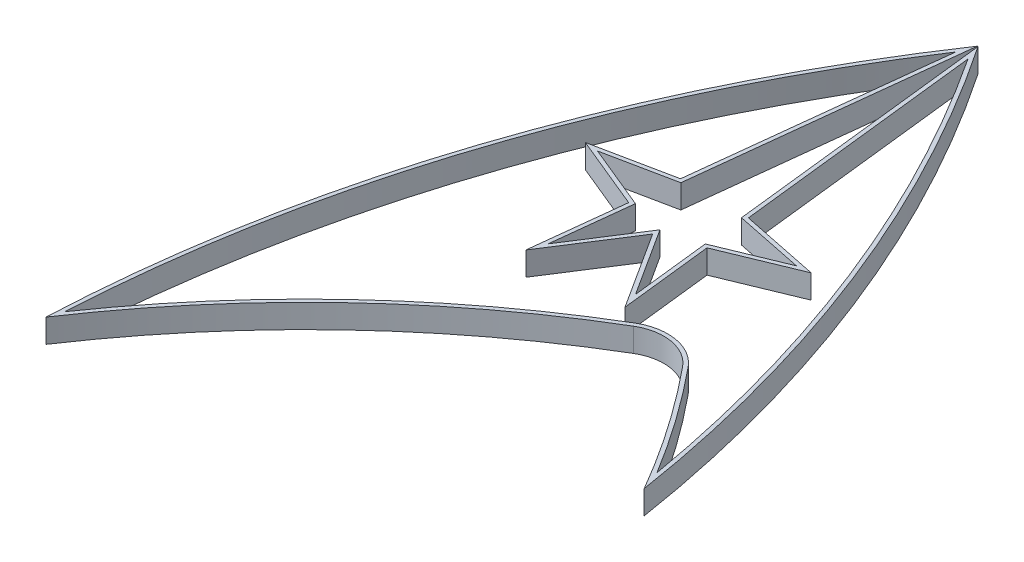
ISO-10303-21;
HEADER;
FILE_DESCRIPTION(('STEP AP214'),'2;1');
FILE_NAME('part.step','',(''),(''),'','','');
FILE_SCHEMA(('AUTOMOTIVE_DESIGN { 1 0 10303 214 1 1 1 1 }'));
ENDSEC;
DATA;
#1=APPLICATION_CONTEXT('core data for automotive mechanical design processes');
#2=APPLICATION_PROTOCOL_DEFINITION('international standard','automotive_design',2000,#1);
#3=PRODUCT_CONTEXT('',#1,'mechanical');
#4=PRODUCT('Part','Part','',(#3));
#5=PRODUCT_RELATED_PRODUCT_CATEGORY('part','',(#4));
#6=PRODUCT_DEFINITION_FORMATION('','',#4);
#7=PRODUCT_DEFINITION_CONTEXT('part definition',#1,'design');
#8=PRODUCT_DEFINITION('design','',#6,#7);
#9=PRODUCT_DEFINITION_SHAPE('','',#8);
#10=(LENGTH_UNIT() NAMED_UNIT(*) SI_UNIT(.MILLI.,.METRE.));
#11=(NAMED_UNIT(*) PLANE_ANGLE_UNIT() SI_UNIT($,.RADIAN.));
#12=(NAMED_UNIT(*) SI_UNIT($,.STERADIAN.) SOLID_ANGLE_UNIT());
#13=UNCERTAINTY_MEASURE_WITH_UNIT(LENGTH_MEASURE(1.E-05),#10,'distance_accuracy_value','');
#14=(GEOMETRIC_REPRESENTATION_CONTEXT(3) GLOBAL_UNCERTAINTY_ASSIGNED_CONTEXT((#13)) GLOBAL_UNIT_ASSIGNED_CONTEXT((#10,
#11,#12)) REPRESENTATION_CONTEXT('',''));
#15=CARTESIAN_POINT('',(0.,0.,0.));
#16=DIRECTION('',(0.,0.,1.));
#17=DIRECTION('',(1.,0.,0.));
#18=AXIS2_PLACEMENT_3D('',#15,#16,#17);
#19=CARTESIAN_POINT('',(-89.3625724009175,2.4,0.));
#20=DIRECTION('',(0.,1.,0.));
#21=DIRECTION('',(0.,0.,1.));
#22=AXIS2_PLACEMENT_3D('',#19,#20,#21);
#23=PLANE('',#22);
#24=CARTESIAN_POINT('',(-89.3625724009175,2.4,0.));
#25=DIRECTION('',(0.,1.,0.));
#26=DIRECTION('',(0.,0.,1.));
#27=AXIS2_PLACEMENT_3D('',#24,#25,#26);
#28=CIRCLE('',#27,138.3);
#29=CARTESIAN_POINT('',(47.2607013612829,2.4,-21.4702367592639));
#30=VERTEX_POINT('',#29);
#31=CARTESIAN_POINT('',(25.3544949285949,2.4,-77.245611288384));
#32=VERTEX_POINT('',#31);
#33=EDGE_CURVE('E349',#30,#32,#28,.T.);
#34=ORIENTED_EDGE('',*,*,#33,.T.);
#35=DIRECTION('',(0.111766710735173,0.,0.993734472769985));
#36=VECTOR('',#35,1.);
#37=CARTESIAN_POINT('',(28.3960320509048,2.4,-50.2028516977339));
#38=LINE('',#37,#36);
#39=CARTESIAN_POINT('',(28.3960320509048,2.4,-50.2028516977339));
#40=VERTEX_POINT('',#39);
#41=EDGE_CURVE('E352',#32,#40,#38,.T.);
#42=ORIENTED_EDGE('',*,*,#41,.T.);
#43=DIRECTION('',(0.979635458817581,0.,0.200784381432589));
#44=VECTOR('',#43,1.);
#45=CARTESIAN_POINT('',(35.4130007020155,2.4,-48.7646659956304));
#46=LINE('',#45,#44);
#47=CARTESIAN_POINT('',(35.4130007020155,2.4,-48.7646659956304));
#48=VERTEX_POINT('',#47);
#49=EDGE_CURVE('E355',#40,#48,#46,.T.);
#50=ORIENTED_EDGE('',*,*,#49,.T.);
#51=DIRECTION('',(-0.924431917366447,0.,0.381347125535508));
#52=VECTOR('',#51,1.);
#53=CARTESIAN_POINT('',(28.8617439083692,2.4,-46.0621382053533));
#54=LINE('',#53,#52);
#55=CARTESIAN_POINT('',(28.8617439083692,2.4,-46.0621382053533));
#56=VERTEX_POINT('',#55);
#57=EDGE_CURVE('E357',#48,#56,#54,.T.);
#58=ORIENTED_EDGE('',*,*,#57,.T.);
#59=DIRECTION('',(0.111766710735173,0.,0.993734472769985));
#60=VECTOR('',#59,1.);
#61=CARTESIAN_POINT('',(29.7585160036163,2.4,-38.088803932533));
#62=LINE('',#61,#60);
#63=CARTESIAN_POINT('',(29.7585160036163,2.4,-38.088803932533));
#64=VERTEX_POINT('',#63);
#65=EDGE_CURVE('E359',#56,#64,#62,.T.);
#66=ORIENTED_EDGE('',*,*,#65,.T.);
#67=DIRECTION('',(-0.540217130768617,0.,-0.841525669022712));
#68=VECTOR('',#67,1.);
#69=CARTESIAN_POINT('',(25.3187137995412,2.4,-45.0049258163335));
#70=LINE('',#69,#68);
#71=CARTESIAN_POINT('',(25.3187137995412,2.4,-45.0049258163335));
#72=VERTEX_POINT('',#71);
#73=EDGE_CURVE('E361',#64,#72,#70,.T.);
#74=ORIENTED_EDGE('',*,*,#73,.T.);
#75=DIRECTION('',(-0.540217130768616,0.,0.841525669022713));
#76=VECTOR('',#75,1.);
#77=CARTESIAN_POINT('',(20.8789115954662,2.4,-38.0888039325331));
#78=LINE('',#77,#76);
#79=CARTESIAN_POINT('',(20.8789115954662,2.4,-38.0888039325331));
#80=VERTEX_POINT('',#79);
#81=EDGE_CURVE('E363',#72,#80,#78,.T.);
#82=ORIENTED_EDGE('',*,*,#81,.T.);
#83=DIRECTION('',(0.111766710735169,0.,-0.993734472769985));
#84=VECTOR('',#83,1.);
#85=CARTESIAN_POINT('',(21.7756836907132,2.4,-46.0621382053533));
#86=LINE('',#85,#84);
#87=CARTESIAN_POINT('',(21.7756836907132,2.4,-46.0621382053533));
#88=VERTEX_POINT('',#87);
#89=EDGE_CURVE('E365',#80,#88,#86,.T.);
#90=ORIENTED_EDGE('',*,*,#89,.T.);
#91=DIRECTION('',(-0.924431917366447,0.,-0.381347125535508));
#92=VECTOR('',#91,1.);
#93=CARTESIAN_POINT('',(15.224426897067,2.4,-48.7646659956304));
#94=LINE('',#93,#92);
#95=CARTESIAN_POINT('',(15.224426897067,2.4,-48.7646659956304));
#96=VERTEX_POINT('',#95);
#97=EDGE_CURVE('E367',#88,#96,#94,.T.);
#98=ORIENTED_EDGE('',*,*,#97,.T.);
#99=DIRECTION('',(0.979635458817581,0.,-0.200784381432589));
#100=VECTOR('',#99,1.);
#101=CARTESIAN_POINT('',(22.2413955481777,2.4,-50.2028516977339));
#102=LINE('',#101,#100);
#103=CARTESIAN_POINT('',(22.2413955481777,2.4,-50.2028516977339));
#104=VERTEX_POINT('',#103);
#105=EDGE_CURVE('E369',#96,#104,#102,.T.);
#106=ORIENTED_EDGE('',*,*,#105,.T.);
#107=DIRECTION('',(0.111766710735173,0.,-0.993734472769985));
#108=VECTOR('',#107,1.);
#109=CARTESIAN_POINT('',(25.2829326704876,2.4,-77.245611288384));
#110=LINE('',#109,#108);
#111=CARTESIAN_POINT('',(25.2829326704876,2.4,-77.245611288384));
#112=VERTEX_POINT('',#111);
#113=EDGE_CURVE('E371',#104,#112,#110,.T.);
#114=ORIENTED_EDGE('',*,*,#113,.T.);
#115=CARTESIAN_POINT('',(140.,2.4,0.));
#116=DIRECTION('',(0.,1.,0.));
#117=DIRECTION('',(0.,0.,1.));
#118=AXIS2_PLACEMENT_3D('',#115,#116,#117);
#119=CIRCLE('',#118,138.3);
#120=CARTESIAN_POINT('',(1.83837783832658,2.4,-6.18515655864835));
#121=VERTEX_POINT('',#120);
#122=EDGE_CURVE('E373',#112,#121,#119,.T.);
#123=ORIENTED_EDGE('',*,*,#122,.T.);
#124=CARTESIAN_POINT('',(80.88892,2.4,46.5627934336495));
#125=DIRECTION('',(0.,-1.,0.));
#126=DIRECTION('',(0.,0.,1.));
#127=AXIS2_PLACEMENT_3D('',#124,#125,#126);
#128=CIRCLE('',#127,95.0333333333333);
#129=CARTESIAN_POINT('',(32.458155801116,2.4,-35.2039205981406));
#130=VERTEX_POINT('',#129);
#131=EDGE_CURVE('E375',#121,#130,#128,.T.);
#132=ORIENTED_EDGE('',*,*,#131,.T.);
#133=CARTESIAN_POINT('',(34.8533637113379,2.4,-31.1600389150531));
#134=DIRECTION('',(0.,-1.,0.));
#135=DIRECTION('',(0.,0.,1.));
#136=AXIS2_PLACEMENT_3D('',#133,#134,#135);
#137=CIRCLE('',#136,4.70000000000001);
#138=CARTESIAN_POINT('',(38.4878007162451,2.4,-34.1401173800203));
#139=VERTEX_POINT('',#138);
#140=EDGE_CURVE('E377',#130,#139,#137,.T.);
#141=ORIENTED_EDGE('',*,*,#140,.T.);
#142=CARTESIAN_POINT('',(-35.,2.4,26.1166464754498));
#143=DIRECTION('',(0.,-1.,0.));
#144=DIRECTION('',(0.,0.,1.));
#145=AXIS2_PLACEMENT_3D('',#142,#143,#144);
#146=CIRCLE('',#145,95.0333333333333);
#147=EDGE_CURVE('E379',#139,#30,#146,.T.);
#148=ORIENTED_EDGE('',*,*,#147,.T.);
#149=EDGE_LOOP('',(#34,#42,#50,#58,#66,#74,#82,#90,#98,#106,#114,#123,#132,#141,#148));
#150=FACE_BOUND('',#149,.T.);
#151=CARTESIAN_POINT('',(80.88892,2.4,46.5627934336495));
#152=DIRECTION('',(0.,-1.,0.));
#153=DIRECTION('',(0.,0.,1.));
#154=AXIS2_PLACEMENT_3D('',#151,#152,#153);
#155=CIRCLE('',#154,95.4333333333333);
#156=CARTESIAN_POINT('',(2.30914418358061,2.4,-7.59198422956674));
#157=VERTEX_POINT('',#156);
#158=CARTESIAN_POINT('',(32.254308319395,2.4,-35.5480807413821));
#159=VERTEX_POINT('',#158);
#160=EDGE_CURVE('E243',#157,#159,#155,.T.);
#161=ORIENTED_EDGE('',*,*,#160,.F.);
#162=CARTESIAN_POINT('',(140.,2.4,0.));
#163=DIRECTION('',(0.,1.,0.));
#164=DIRECTION('',(0.,0.,1.));
#165=AXIS2_PLACEMENT_3D('',#162,#163,#164);
#166=CIRCLE('',#165,137.9);
#167=CARTESIAN_POINT('',(24.7006060145054,2.4,-75.6469414224904));
#168=VERTEX_POINT('',#167);
#169=EDGE_CURVE('E235',#168,#157,#166,.T.);
#170=ORIENTED_EDGE('',*,*,#169,.F.);
#171=DIRECTION('',(0.111766710735173,0.,-0.993734472769985));
#172=VECTOR('',#171,1.);
#173=CARTESIAN_POINT('',(24.7006060145054,2.4,-75.6469414224904));
#174=LINE('',#173,#172);
#175=CARTESIAN_POINT('',(21.8763830664954,2.4,-50.536354524433));
#176=VERTEX_POINT('',#175);
#177=EDGE_CURVE('E282',#176,#168,#174,.T.);
#178=ORIENTED_EDGE('',*,*,#177,.F.);
#179=DIRECTION('',(0.979635458817581,0.,-0.200784381432588));
#180=VECTOR('',#179,1.);
#181=CARTESIAN_POINT('',(21.8763830664954,2.4,-50.536354524433));
#182=LINE('',#181,#180);
#183=CARTESIAN_POINT('',(13.8624151808138,2.4,-48.8938255915896));
#184=VERTEX_POINT('',#183);
#185=EDGE_CURVE('E280',#184,#176,#182,.T.);
#186=ORIENTED_EDGE('',*,*,#185,.F.);
#187=DIRECTION('',(-0.924431917366446,0.,-0.381347125535509));
#188=VECTOR('',#187,1.);
#189=CARTESIAN_POINT('',(13.8624151808138,2.4,-48.8938255915896));
#190=LINE('',#189,#188);
#191=CARTESIAN_POINT('',(21.3445009881694,2.4,-45.8073117423343));
#192=VERTEX_POINT('',#191);
#193=EDGE_CURVE('E278',#192,#184,#190,.T.);
#194=ORIENTED_EDGE('',*,*,#193,.F.);
#195=DIRECTION('',(0.11176671073517,0.,-0.993734472769985));
#196=VECTOR('',#195,1.);
#197=CARTESIAN_POINT('',(21.3445009881694,2.4,-45.8073117423343));
#198=LINE('',#197,#196);
#199=CARTESIAN_POINT('',(20.289917478852,2.4,-36.4308526810429));
#200=VERTEX_POINT('',#199);
#201=EDGE_CURVE('E276',#200,#192,#198,.T.);
#202=ORIENTED_EDGE('',*,*,#201,.F.);
#203=DIRECTION('',(-0.540217130768616,0.,0.841525669022713));
#204=VECTOR('',#203,1.);
#205=CARTESIAN_POINT('',(20.289917478852,2.4,-36.4308526810429));
#206=LINE('',#205,#204);
#207=CARTESIAN_POINT('',(25.3187137995412,2.4,-44.2644828032975));
#208=VERTEX_POINT('',#207);
#209=EDGE_CURVE('E274',#208,#200,#206,.T.);
#210=ORIENTED_EDGE('',*,*,#209,.F.);
#211=DIRECTION('',(-0.540217130768617,0.,-0.841525669022712));
#212=VECTOR('',#211,1.);
#213=CARTESIAN_POINT('',(25.3187137995412,2.4,-44.2644828032975));
#214=LINE('',#213,#212);
#215=CARTESIAN_POINT('',(30.3475101202306,2.4,-36.4308526810428));
#216=VERTEX_POINT('',#215);
#217=EDGE_CURVE('E272',#216,#208,#214,.T.);
#218=ORIENTED_EDGE('',*,*,#217,.F.);
#219=DIRECTION('',(0.111766710735173,0.,0.993734472769985));
#220=VECTOR('',#219,1.);
#221=CARTESIAN_POINT('',(30.3475101202306,2.4,-36.4308526810428));
#222=LINE('',#221,#220);
#223=CARTESIAN_POINT('',(29.292926610913,2.4,-45.8073117423343));
#224=VERTEX_POINT('',#223);
#225=EDGE_CURVE('E270',#224,#216,#222,.T.);
#226=ORIENTED_EDGE('',*,*,#225,.F.);
#227=DIRECTION('',(-0.924431917366447,0.,0.381347125535508));
#228=VECTOR('',#227,1.);
#229=CARTESIAN_POINT('',(29.292926610913,2.4,-45.8073117423343));
#230=LINE('',#229,#228);
#231=CARTESIAN_POINT('',(36.7750124182687,2.4,-48.8938255915896));
#232=VERTEX_POINT('',#231);
#233=EDGE_CURVE('E268',#232,#224,#230,.T.);
#234=ORIENTED_EDGE('',*,*,#233,.F.);
#235=DIRECTION('',(0.979635458817581,0.,0.200784381432589));
#236=VECTOR('',#235,1.);
#237=CARTESIAN_POINT('',(36.7750124182687,2.4,-48.8938255915896));
#238=LINE('',#237,#236);
#239=CARTESIAN_POINT('',(28.7610445325871,2.4,-50.536354524433));
#240=VERTEX_POINT('',#239);
#241=EDGE_CURVE('E266',#240,#232,#238,.T.);
#242=ORIENTED_EDGE('',*,*,#241,.F.);
#243=DIRECTION('',(0.111766710735172,0.,0.993734472769985));
#244=VECTOR('',#243,1.);
#245=CARTESIAN_POINT('',(28.7610445325871,2.4,-50.536354524433));
#246=LINE('',#245,#244);
#247=CARTESIAN_POINT('',(25.9368215845771,2.4,-75.6469414224903));
#248=VERTEX_POINT('',#247);
#249=EDGE_CURVE('E264',#248,#240,#246,.T.);
#250=ORIENTED_EDGE('',*,*,#249,.F.);
#251=CARTESIAN_POINT('',(-89.3625724009175,2.4,0.));
#252=DIRECTION('',(0.,1.,0.));
#253=DIRECTION('',(0.,0.,1.));
#254=AXIS2_PLACEMENT_3D('',#251,#252,#253);
#255=CIRCLE('',#254,137.9);
#256=CARTESIAN_POINT('',(46.5199599768203,2.4,-23.5020721344531));
#257=VERTEX_POINT('',#256);
#258=EDGE_CURVE('E262',#257,#248,#255,.T.);
#259=ORIENTED_EDGE('',*,*,#258,.F.);
#260=CARTESIAN_POINT('',(-35.,2.4,26.1166464754498));
#261=DIRECTION('',(0.,-1.,0.));
#262=DIRECTION('',(0.,0.,1.));
#263=AXIS2_PLACEMENT_3D('',#260,#261,#262);
#264=CIRCLE('',#263,95.4333333333333);
#265=CARTESIAN_POINT('',(38.7971145038968,2.4,-34.3937410791664));
#266=VERTEX_POINT('',#265);
#267=EDGE_CURVE('E258',#266,#257,#264,.T.);
#268=ORIENTED_EDGE('',*,*,#267,.F.);
#269=CARTESIAN_POINT('',(34.8533637113379,2.4,-31.1600389150531));
#270=DIRECTION('',(0.,-1.,0.));
#271=DIRECTION('',(0.,0.,1.));
#272=AXIS2_PLACEMENT_3D('',#269,#270,#271);
#273=CIRCLE('',#272,5.1);
#274=EDGE_CURVE('E256',#159,#266,#273,.T.);
#275=ORIENTED_EDGE('',*,*,#274,.F.);
#276=EDGE_LOOP('',(#161,#170,#178,#186,#194,#202,#210,#218,#226,#234,#242,#250,#259,#268,#275));
#277=FACE_BOUND('',#276,.T.);
#278=ADVANCED_FACE('F38',(#150,#277),#23,.T.);
#279=CARTESIAN_POINT('',(-89.3625724009175,0.,0.));
#280=DIRECTION('',(0.,1.,0.));
#281=DIRECTION('',(0.,0.,1.));
#282=AXIS2_PLACEMENT_3D('',#279,#280,#281);
#283=PLANE('',#282);
#284=CARTESIAN_POINT('',(-89.3625724009175,0.,0.));
#285=DIRECTION('',(0.,1.,0.));
#286=DIRECTION('',(0.,0.,1.));
#287=AXIS2_PLACEMENT_3D('',#284,#285,#286);
#288=CIRCLE('',#287,138.3);
#289=CARTESIAN_POINT('',(47.2607013612829,0.,-21.4702367592639));
#290=VERTEX_POINT('',#289);
#291=CARTESIAN_POINT('',(25.3544949285949,0.,-77.245611288384));
#292=VERTEX_POINT('',#291);
#293=EDGE_CURVE('E251',#290,#292,#288,.T.);
#294=ORIENTED_EDGE('',*,*,#293,.F.);
#295=CARTESIAN_POINT('',(-35.,0.,26.1166464754498));
#296=DIRECTION('',(0.,-1.,0.));
#297=DIRECTION('',(0.,0.,1.));
#298=AXIS2_PLACEMENT_3D('',#295,#296,#297);
#299=CIRCLE('',#298,95.0333333333333);
#300=CARTESIAN_POINT('',(38.4878007162451,0.,-34.1401173800203));
#301=VERTEX_POINT('',#300);
#302=EDGE_CURVE('E353',#301,#290,#299,.T.);
#303=ORIENTED_EDGE('',*,*,#302,.F.);
#304=CARTESIAN_POINT('',(34.8533637113379,0.,-31.1600389150531));
#305=DIRECTION('',(0.,-1.,0.));
#306=DIRECTION('',(0.,0.,1.));
#307=AXIS2_PLACEMENT_3D('',#304,#305,#306);
#308=CIRCLE('',#307,4.70000000000001);
#309=CARTESIAN_POINT('',(32.458155801116,0.,-35.2039205981406));
#310=VERTEX_POINT('',#309);
#311=EDGE_CURVE('E408',#310,#301,#308,.T.);
#312=ORIENTED_EDGE('',*,*,#311,.F.);
#313=CARTESIAN_POINT('',(80.88892,0.,46.5627934336495));
#314=DIRECTION('',(0.,-1.,0.));
#315=DIRECTION('',(0.,0.,1.));
#316=AXIS2_PLACEMENT_3D('',#313,#314,#315);
#317=CIRCLE('',#316,95.0333333333333);
#318=CARTESIAN_POINT('',(1.83837783832658,0.,-6.18515655864835));
#319=VERTEX_POINT('',#318);
#320=EDGE_CURVE('E406',#319,#310,#317,.T.);
#321=ORIENTED_EDGE('',*,*,#320,.F.);
#322=CARTESIAN_POINT('',(140.,0.,0.));
#323=DIRECTION('',(0.,1.,0.));
#324=DIRECTION('',(0.,0.,1.));
#325=AXIS2_PLACEMENT_3D('',#322,#323,#324);
#326=CIRCLE('',#325,138.3);
#327=CARTESIAN_POINT('',(25.2829326704876,0.,-77.245611288384));
#328=VERTEX_POINT('',#327);
#329=EDGE_CURVE('E404',#328,#319,#326,.T.);
#330=ORIENTED_EDGE('',*,*,#329,.F.);
#331=DIRECTION('',(0.111766710735173,0.,-0.993734472769985));
#332=VECTOR('',#331,1.);
#333=CARTESIAN_POINT('',(25.2829326704876,0.,-77.245611288384));
#334=LINE('',#333,#332);
#335=CARTESIAN_POINT('',(22.2413955481777,0.,-50.2028516977339));
#336=VERTEX_POINT('',#335);
#337=EDGE_CURVE('E402',#336,#328,#334,.T.);
#338=ORIENTED_EDGE('',*,*,#337,.F.);
#339=DIRECTION('',(0.979635458817581,0.,-0.200784381432589));
#340=VECTOR('',#339,1.);
#341=CARTESIAN_POINT('',(22.2413955481777,0.,-50.2028516977339));
#342=LINE('',#341,#340);
#343=CARTESIAN_POINT('',(15.224426897067,0.,-48.7646659956304));
#344=VERTEX_POINT('',#343);
#345=EDGE_CURVE('E400',#344,#336,#342,.T.);
#346=ORIENTED_EDGE('',*,*,#345,.F.);
#347=DIRECTION('',(-0.924431917366447,0.,-0.381347125535508));
#348=VECTOR('',#347,1.);
#349=CARTESIAN_POINT('',(15.224426897067,0.,-48.7646659956304));
#350=LINE('',#349,#348);
#351=CARTESIAN_POINT('',(21.7756836907132,0.,-46.0621382053533));
#352=VERTEX_POINT('',#351);
#353=EDGE_CURVE('E398',#352,#344,#350,.T.);
#354=ORIENTED_EDGE('',*,*,#353,.F.);
#355=DIRECTION('',(0.111766710735169,0.,-0.993734472769985));
#356=VECTOR('',#355,1.);
#357=CARTESIAN_POINT('',(21.7756836907132,0.,-46.0621382053533));
#358=LINE('',#357,#356);
#359=CARTESIAN_POINT('',(20.8789115954662,0.,-38.0888039325331));
#360=VERTEX_POINT('',#359);
#361=EDGE_CURVE('E396',#360,#352,#358,.T.);
#362=ORIENTED_EDGE('',*,*,#361,.F.);
#363=DIRECTION('',(-0.540217130768616,0.,0.841525669022713));
#364=VECTOR('',#363,1.);
#365=CARTESIAN_POINT('',(20.8789115954662,0.,-38.0888039325331));
#366=LINE('',#365,#364);
#367=CARTESIAN_POINT('',(25.3187137995412,0.,-45.0049258163335));
#368=VERTEX_POINT('',#367);
#369=EDGE_CURVE('E394',#368,#360,#366,.T.);
#370=ORIENTED_EDGE('',*,*,#369,.F.);
#371=DIRECTION('',(-0.540217130768617,0.,-0.841525669022712));
#372=VECTOR('',#371,1.);
#373=CARTESIAN_POINT('',(25.3187137995412,0.,-45.0049258163335));
#374=LINE('',#373,#372);
#375=CARTESIAN_POINT('',(29.7585160036163,0.,-38.088803932533));
#376=VERTEX_POINT('',#375);
#377=EDGE_CURVE('E392',#376,#368,#374,.T.);
#378=ORIENTED_EDGE('',*,*,#377,.F.);
#379=DIRECTION('',(0.111766710735173,0.,0.993734472769985));
#380=VECTOR('',#379,1.);
#381=CARTESIAN_POINT('',(29.7585160036163,0.,-38.088803932533));
#382=LINE('',#381,#380);
#383=CARTESIAN_POINT('',(28.8617439083692,0.,-46.0621382053533));
#384=VERTEX_POINT('',#383);
#385=EDGE_CURVE('E390',#384,#376,#382,.T.);
#386=ORIENTED_EDGE('',*,*,#385,.F.);
#387=DIRECTION('',(-0.924431917366447,0.,0.381347125535508));
#388=VECTOR('',#387,1.);
#389=CARTESIAN_POINT('',(28.8617439083692,0.,-46.0621382053533));
#390=LINE('',#389,#388);
#391=CARTESIAN_POINT('',(35.4130007020155,0.,-48.7646659956304));
#392=VERTEX_POINT('',#391);
#393=EDGE_CURVE('E388',#392,#384,#390,.T.);
#394=ORIENTED_EDGE('',*,*,#393,.F.);
#395=DIRECTION('',(0.979635458817581,0.,0.200784381432589));
#396=VECTOR('',#395,1.);
#397=CARTESIAN_POINT('',(35.4130007020155,0.,-48.7646659956304));
#398=LINE('',#397,#396);
#399=CARTESIAN_POINT('',(28.3960320509048,0.,-50.2028516977339));
#400=VERTEX_POINT('',#399);
#401=EDGE_CURVE('E386',#400,#392,#398,.T.);
#402=ORIENTED_EDGE('',*,*,#401,.F.);
#403=DIRECTION('',(0.111766710735173,0.,0.993734472769985));
#404=VECTOR('',#403,1.);
#405=CARTESIAN_POINT('',(28.3960320509048,0.,-50.2028516977339));
#406=LINE('',#405,#404);
#407=EDGE_CURVE('E384',#292,#400,#406,.T.);
#408=ORIENTED_EDGE('',*,*,#407,.F.);
#409=EDGE_LOOP('',(#294,#303,#312,#321,#330,#338,#346,#354,#362,#370,#378,#386,#394,#402,#408));
#410=FACE_BOUND('',#409,.T.);
#411=CARTESIAN_POINT('',(140.,0.,0.));
#412=DIRECTION('',(0.,1.,0.));
#413=DIRECTION('',(0.,0.,1.));
#414=AXIS2_PLACEMENT_3D('',#411,#412,#413);
#415=CIRCLE('',#414,137.9);
#416=CARTESIAN_POINT('',(24.7006060145054,0.,-75.6469414224904));
#417=VERTEX_POINT('',#416);
#418=CARTESIAN_POINT('',(2.30914418358061,0.,-7.59198422956674));
#419=VERTEX_POINT('',#418);
#420=EDGE_CURVE('E61',#417,#419,#415,.T.);
#421=ORIENTED_EDGE('',*,*,#420,.T.);
#422=CARTESIAN_POINT('',(80.88892,0.,46.5627934336495));
#423=DIRECTION('',(0.,-1.,0.));
#424=DIRECTION('',(0.,0.,1.));
#425=AXIS2_PLACEMENT_3D('',#422,#423,#424);
#426=CIRCLE('',#425,95.4333333333333);
#427=CARTESIAN_POINT('',(32.254308319395,0.,-35.5480807413821));
#428=VERTEX_POINT('',#427);
#429=EDGE_CURVE('E250',#419,#428,#426,.T.);
#430=ORIENTED_EDGE('',*,*,#429,.T.);
#431=CARTESIAN_POINT('',(34.8533637113379,0.,-31.1600389150531));
#432=DIRECTION('',(0.,-1.,0.));
#433=DIRECTION('',(0.,0.,1.));
#434=AXIS2_PLACEMENT_3D('',#431,#432,#433);
#435=CIRCLE('',#434,5.1);
#436=CARTESIAN_POINT('',(38.7971145038968,0.,-34.3937410791664));
#437=VERTEX_POINT('',#436);
#438=EDGE_CURVE('E286',#428,#437,#435,.T.);
#439=ORIENTED_EDGE('',*,*,#438,.T.);
#440=CARTESIAN_POINT('',(-35.,0.,26.1166464754498));
#441=DIRECTION('',(0.,-1.,0.));
#442=DIRECTION('',(0.,0.,1.));
#443=AXIS2_PLACEMENT_3D('',#440,#441,#442);
#444=CIRCLE('',#443,95.4333333333333);
#445=CARTESIAN_POINT('',(46.5199599768203,0.,-23.5020721344531));
#446=VERTEX_POINT('',#445);
#447=EDGE_CURVE('E289',#437,#446,#444,.T.);
#448=ORIENTED_EDGE('',*,*,#447,.T.);
#449=CARTESIAN_POINT('',(-89.3625724009175,0.,0.));
#450=DIRECTION('',(0.,1.,0.));
#451=DIRECTION('',(0.,0.,1.));
#452=AXIS2_PLACEMENT_3D('',#449,#450,#451);
#453=CIRCLE('',#452,137.9);
#454=CARTESIAN_POINT('',(25.9368215845771,0.,-75.6469414224903));
#455=VERTEX_POINT('',#454);
#456=EDGE_CURVE('E292',#446,#455,#453,.T.);
#457=ORIENTED_EDGE('',*,*,#456,.T.);
#458=DIRECTION('',(0.111766710735172,0.,0.993734472769985));
#459=VECTOR('',#458,1.);
#460=CARTESIAN_POINT('',(28.7610445325871,0.,-50.536354524433));
#461=LINE('',#460,#459);
#462=CARTESIAN_POINT('',(28.7610445325871,0.,-50.536354524433));
#463=VERTEX_POINT('',#462);
#464=EDGE_CURVE('E295',#455,#463,#461,.T.);
#465=ORIENTED_EDGE('',*,*,#464,.T.);
#466=DIRECTION('',(0.979635458817581,0.,0.200784381432589));
#467=VECTOR('',#466,1.);
#468=CARTESIAN_POINT('',(36.7750124182687,0.,-48.8938255915896));
#469=LINE('',#468,#467);
#470=CARTESIAN_POINT('',(36.7750124182687,0.,-48.8938255915896));
#471=VERTEX_POINT('',#470);
#472=EDGE_CURVE('E298',#463,#471,#469,.T.);
#473=ORIENTED_EDGE('',*,*,#472,.T.);
#474=DIRECTION('',(-0.924431917366447,0.,0.381347125535508));
#475=VECTOR('',#474,1.);
#476=CARTESIAN_POINT('',(29.292926610913,0.,-45.8073117423343));
#477=LINE('',#476,#475);
#478=CARTESIAN_POINT('',(29.292926610913,0.,-45.8073117423343));
#479=VERTEX_POINT('',#478);
#480=EDGE_CURVE('E301',#471,#479,#477,.T.);
#481=ORIENTED_EDGE('',*,*,#480,.T.);
#482=DIRECTION('',(0.111766710735173,0.,0.993734472769985));
#483=VECTOR('',#482,1.);
#484=CARTESIAN_POINT('',(30.3475101202306,0.,-36.4308526810428));
#485=LINE('',#484,#483);
#486=CARTESIAN_POINT('',(30.3475101202306,0.,-36.4308526810428));
#487=VERTEX_POINT('',#486);
#488=EDGE_CURVE('E304',#479,#487,#485,.T.);
#489=ORIENTED_EDGE('',*,*,#488,.T.);
#490=DIRECTION('',(-0.540217130768617,0.,-0.841525669022712));
#491=VECTOR('',#490,1.);
#492=CARTESIAN_POINT('',(25.3187137995412,0.,-44.2644828032975));
#493=LINE('',#492,#491);
#494=CARTESIAN_POINT('',(25.3187137995412,0.,-44.2644828032975));
#495=VERTEX_POINT('',#494);
#496=EDGE_CURVE('E307',#487,#495,#493,.T.);
#497=ORIENTED_EDGE('',*,*,#496,.T.);
#498=DIRECTION('',(-0.540217130768616,0.,0.841525669022713));
#499=VECTOR('',#498,1.);
#500=CARTESIAN_POINT('',(20.289917478852,0.,-36.4308526810429));
#501=LINE('',#500,#499);
#502=CARTESIAN_POINT('',(20.289917478852,0.,-36.4308526810429));
#503=VERTEX_POINT('',#502);
#504=EDGE_CURVE('E310',#495,#503,#501,.T.);
#505=ORIENTED_EDGE('',*,*,#504,.T.);
#506=DIRECTION('',(0.11176671073517,0.,-0.993734472769985));
#507=VECTOR('',#506,1.);
#508=CARTESIAN_POINT('',(21.3445009881694,0.,-45.8073117423343));
#509=LINE('',#508,#507);
#510=CARTESIAN_POINT('',(21.3445009881694,0.,-45.8073117423343));
#511=VERTEX_POINT('',#510);
#512=EDGE_CURVE('E313',#503,#511,#509,.T.);
#513=ORIENTED_EDGE('',*,*,#512,.T.);
#514=DIRECTION('',(-0.924431917366446,0.,-0.381347125535509));
#515=VECTOR('',#514,1.);
#516=CARTESIAN_POINT('',(13.8624151808138,0.,-48.8938255915896));
#517=LINE('',#516,#515);
#518=CARTESIAN_POINT('',(13.8624151808138,0.,-48.8938255915896));
#519=VERTEX_POINT('',#518);
#520=EDGE_CURVE('E316',#511,#519,#517,.T.);
#521=ORIENTED_EDGE('',*,*,#520,.T.);
#522=DIRECTION('',(0.979635458817581,0.,-0.200784381432588));
#523=VECTOR('',#522,1.);
#524=CARTESIAN_POINT('',(21.8763830664954,0.,-50.536354524433));
#525=LINE('',#524,#523);
#526=CARTESIAN_POINT('',(21.8763830664954,0.,-50.536354524433));
#527=VERTEX_POINT('',#526);
#528=EDGE_CURVE('E319',#519,#527,#525,.T.);
#529=ORIENTED_EDGE('',*,*,#528,.T.);
#530=DIRECTION('',(0.111766710735173,0.,-0.993734472769985));
#531=VECTOR('',#530,1.);
#532=CARTESIAN_POINT('',(24.7006060145054,0.,-75.6469414224904));
#533=LINE('',#532,#531);
#534=EDGE_CURVE('E244',#527,#417,#533,.T.);
#535=ORIENTED_EDGE('',*,*,#534,.T.);
#536=EDGE_LOOP('',(#421,#430,#439,#448,#457,#465,#473,#481,#489,#497,#505,#513,#521,#529,#535));
#537=FACE_BOUND('',#536,.T.);
#538=ADVANCED_FACE('F459',(#410,#537),#283,.F.);
#539=CARTESIAN_POINT('',(-89.3625724009175,2.4,0.));
#540=DIRECTION('',(0.,-1.,0.));
#541=DIRECTION('',(0.,0.,-1.));
#542=AXIS2_PLACEMENT_3D('',#539,#540,#541);
#543=CYLINDRICAL_SURFACE('',#542,138.3);
#544=ORIENTED_EDGE('',*,*,#293,.T.);
#545=DIRECTION('',(0.,-1.,0.));
#546=VECTOR('',#545,1.);
#547=CARTESIAN_POINT('',(25.3544949285949,2.4,-77.245611288384));
#548=LINE('',#547,#546);
#549=EDGE_CURVE('E11',#32,#292,#548,.T.);
#550=ORIENTED_EDGE('',*,*,#549,.F.);
#551=ORIENTED_EDGE('',*,*,#33,.F.);
#552=DIRECTION('',(0.,-1.,0.));
#553=VECTOR('',#552,1.);
#554=CARTESIAN_POINT('',(47.2607013612829,2.4,-21.4702367592639));
#555=LINE('',#554,#553);
#556=EDGE_CURVE('E381',#30,#290,#555,.T.);
#557=ORIENTED_EDGE('',*,*,#556,.T.);
#558=EDGE_LOOP('',(#544,#550,#551,#557));
#559=FACE_BOUND('',#558,.T.);
#560=ADVANCED_FACE('F40',(#559),#543,.T.);
#561=CARTESIAN_POINT('',(28.3960320509048,2.4,-50.2028516977339));
#562=DIRECTION('',(0.993734472769985,0.,-0.111766710735173));
#563=DIRECTION('',(-0.111766710735173,0.,-0.993734472769985));
#564=AXIS2_PLACEMENT_3D('',#561,#562,#563);
#565=PLANE('',#564);
#566=ORIENTED_EDGE('',*,*,#407,.T.);
#567=DIRECTION('',(0.,-1.,0.));
#568=VECTOR('',#567,1.);
#569=CARTESIAN_POINT('',(28.3960320509048,2.4,-50.2028516977339));
#570=LINE('',#569,#568);
#571=EDGE_CURVE('E46',#40,#400,#570,.T.);
#572=ORIENTED_EDGE('',*,*,#571,.F.);
#573=ORIENTED_EDGE('',*,*,#41,.F.);
#574=ORIENTED_EDGE('',*,*,#549,.T.);
#575=EDGE_LOOP('',(#566,#572,#573,#574));
#576=FACE_BOUND('',#575,.T.);
#577=ADVANCED_FACE('F476',(#576),#565,.F.);
#578=CARTESIAN_POINT('',(35.4130007020155,2.4,-48.7646659956304));
#579=DIRECTION('',(0.200784381432589,0.,-0.979635458817581));
#580=DIRECTION('',(-0.979635458817581,0.,-0.200784381432589));
#581=AXIS2_PLACEMENT_3D('',#578,#579,#580);
#582=PLANE('',#581);
#583=ORIENTED_EDGE('',*,*,#401,.T.);
#584=DIRECTION('',(0.,-1.,0.));
#585=VECTOR('',#584,1.);
#586=CARTESIAN_POINT('',(35.4130007020155,2.4,-48.7646659956304));
#587=LINE('',#586,#585);
#588=EDGE_CURVE('E446',#48,#392,#587,.T.);
#589=ORIENTED_EDGE('',*,*,#588,.F.);
#590=ORIENTED_EDGE('',*,*,#49,.F.);
#591=ORIENTED_EDGE('',*,*,#571,.T.);
#592=EDGE_LOOP('',(#583,#589,#590,#591));
#593=FACE_BOUND('',#592,.T.);
#594=ADVANCED_FACE('F453',(#593),#582,.F.);
#595=CARTESIAN_POINT('',(28.8617439083692,2.4,-46.0621382053533));
#596=DIRECTION('',(0.381347125535508,0.,0.924431917366447));
#597=DIRECTION('',(0.924431917366447,0.,-0.381347125535508));
#598=AXIS2_PLACEMENT_3D('',#595,#596,#597);
#599=PLANE('',#598);
#600=ORIENTED_EDGE('',*,*,#393,.T.);
#601=DIRECTION('',(0.,-1.,0.));
#602=VECTOR('',#601,1.);
#603=CARTESIAN_POINT('',(28.8617439083692,2.4,-46.0621382053533));
#604=LINE('',#603,#602);
#605=EDGE_CURVE('E443',#56,#384,#604,.T.);
#606=ORIENTED_EDGE('',*,*,#605,.F.);
#607=ORIENTED_EDGE('',*,*,#57,.F.);
#608=ORIENTED_EDGE('',*,*,#588,.T.);
#609=EDGE_LOOP('',(#600,#606,#607,#608));
#610=FACE_BOUND('',#609,.T.);
#611=ADVANCED_FACE('F465',(#610),#599,.F.);
#612=CARTESIAN_POINT('',(29.7585160036163,2.4,-38.088803932533));
#613=DIRECTION('',(0.993734472769985,0.,-0.111766710735173));
#614=DIRECTION('',(-0.111766710735173,0.,-0.993734472769985));
#615=AXIS2_PLACEMENT_3D('',#612,#613,#614);
#616=PLANE('',#615);
#617=ORIENTED_EDGE('',*,*,#385,.T.);
#618=DIRECTION('',(0.,-1.,0.));
#619=VECTOR('',#618,1.);
#620=CARTESIAN_POINT('',(29.7585160036163,2.4,-38.088803932533));
#621=LINE('',#620,#619);
#622=EDGE_CURVE('E440',#64,#376,#621,.T.);
#623=ORIENTED_EDGE('',*,*,#622,.F.);
#624=ORIENTED_EDGE('',*,*,#65,.F.);
#625=ORIENTED_EDGE('',*,*,#605,.T.);
#626=EDGE_LOOP('',(#617,#623,#624,#625));
#627=FACE_BOUND('',#626,.T.);
#628=ADVANCED_FACE('F469',(#627),#616,.F.);
#629=CARTESIAN_POINT('',(25.3187137995412,2.4,-45.0049258163335));
#630=DIRECTION('',(-0.841525669022712,0.,0.540217130768617));
#631=DIRECTION('',(0.540217130768617,0.,0.841525669022712));
#632=AXIS2_PLACEMENT_3D('',#629,#630,#631);
#633=PLANE('',#632);
#634=ORIENTED_EDGE('',*,*,#377,.T.);
#635=DIRECTION('',(0.,-1.,0.));
#636=VECTOR('',#635,1.);
#637=CARTESIAN_POINT('',(25.3187137995412,2.4,-45.0049258163335));
#638=LINE('',#637,#636);
#639=EDGE_CURVE('E437',#72,#368,#638,.T.);
#640=ORIENTED_EDGE('',*,*,#639,.F.);
#641=ORIENTED_EDGE('',*,*,#73,.F.);
#642=ORIENTED_EDGE('',*,*,#622,.T.);
#643=EDGE_LOOP('',(#634,#640,#641,#642));
#644=FACE_BOUND('',#643,.T.);
#645=ADVANCED_FACE('F524',(#644),#633,.F.);
#646=CARTESIAN_POINT('',(20.8789115954662,2.4,-38.0888039325331));
#647=DIRECTION('',(0.841525669022713,0.,0.540217130768616));
#648=DIRECTION('',(0.540217130768616,0.,-0.841525669022713));
#649=AXIS2_PLACEMENT_3D('',#646,#647,#648);
#650=PLANE('',#649);
#651=ORIENTED_EDGE('',*,*,#369,.T.);
#652=DIRECTION('',(0.,-1.,0.));
#653=VECTOR('',#652,1.);
#654=CARTESIAN_POINT('',(20.8789115954662,2.4,-38.0888039325331));
#655=LINE('',#654,#653);
#656=EDGE_CURVE('E434',#80,#360,#655,.T.);
#657=ORIENTED_EDGE('',*,*,#656,.F.);
#658=ORIENTED_EDGE('',*,*,#81,.F.);
#659=ORIENTED_EDGE('',*,*,#639,.T.);
#660=EDGE_LOOP('',(#651,#657,#658,#659));
#661=FACE_BOUND('',#660,.T.);
#662=ADVANCED_FACE('F522',(#661),#650,.F.);
#663=CARTESIAN_POINT('',(21.7756836907132,2.4,-46.0621382053533));
#664=DIRECTION('',(-0.993734472769985,0.,-0.111766710735169));
#665=DIRECTION('',(-0.111766710735169,0.,0.993734472769986));
#666=AXIS2_PLACEMENT_3D('',#663,#664,#665);
#667=PLANE('',#666);
#668=ORIENTED_EDGE('',*,*,#361,.T.);
#669=DIRECTION('',(0.,-1.,0.));
#670=VECTOR('',#669,1.);
#671=CARTESIAN_POINT('',(21.7756836907132,2.4,-46.0621382053533));
#672=LINE('',#671,#670);
#673=EDGE_CURVE('E431',#88,#352,#672,.T.);
#674=ORIENTED_EDGE('',*,*,#673,.F.);
#675=ORIENTED_EDGE('',*,*,#89,.F.);
#676=ORIENTED_EDGE('',*,*,#656,.T.);
#677=EDGE_LOOP('',(#668,#674,#675,#676));
#678=FACE_BOUND('',#677,.T.);
#679=ADVANCED_FACE('F518',(#678),#667,.F.);
#680=CARTESIAN_POINT('',(15.224426897067,2.4,-48.7646659956304));
#681=DIRECTION('',(-0.381347125535509,0.,0.924431917366447));
#682=DIRECTION('',(0.924431917366447,0.,0.381347125535509));
#683=AXIS2_PLACEMENT_3D('',#680,#681,#682);
#684=PLANE('',#683);
#685=ORIENTED_EDGE('',*,*,#353,.T.);
#686=DIRECTION('',(0.,-1.,0.));
#687=VECTOR('',#686,1.);
#688=CARTESIAN_POINT('',(15.224426897067,2.4,-48.7646659956304));
#689=LINE('',#688,#687);
#690=EDGE_CURVE('E428',#96,#344,#689,.T.);
#691=ORIENTED_EDGE('',*,*,#690,.F.);
#692=ORIENTED_EDGE('',*,*,#97,.F.);
#693=ORIENTED_EDGE('',*,*,#673,.T.);
#694=EDGE_LOOP('',(#685,#691,#692,#693));
#695=FACE_BOUND('',#694,.T.);
#696=ADVANCED_FACE('F513',(#695),#684,.F.);
#697=CARTESIAN_POINT('',(22.2413955481777,2.4,-50.2028516977339));
#698=DIRECTION('',(-0.200784381432589,0.,-0.979635458817581));
#699=DIRECTION('',(-0.979635458817581,0.,0.200784381432589));
#700=AXIS2_PLACEMENT_3D('',#697,#698,#699);
#701=PLANE('',#700);
#702=ORIENTED_EDGE('',*,*,#345,.T.);
#703=DIRECTION('',(0.,-1.,0.));
#704=VECTOR('',#703,1.);
#705=CARTESIAN_POINT('',(22.2413955481777,2.4,-50.2028516977339));
#706=LINE('',#705,#704);
#707=EDGE_CURVE('E425',#104,#336,#706,.T.);
#708=ORIENTED_EDGE('',*,*,#707,.F.);
#709=ORIENTED_EDGE('',*,*,#105,.F.);
#710=ORIENTED_EDGE('',*,*,#690,.T.);
#711=EDGE_LOOP('',(#702,#708,#709,#710));
#712=FACE_BOUND('',#711,.T.);
#713=ADVANCED_FACE('F507',(#712),#701,.F.);
#714=CARTESIAN_POINT('',(25.2829326704876,2.4,-77.245611288384));
#715=DIRECTION('',(-0.993734472769985,0.,-0.111766710735173));
#716=DIRECTION('',(-0.111766710735173,0.,0.993734472769985));
#717=AXIS2_PLACEMENT_3D('',#714,#715,#716);
#718=PLANE('',#717);
#719=ORIENTED_EDGE('',*,*,#337,.T.);
#720=DIRECTION('',(0.,-1.,0.));
#721=VECTOR('',#720,1.);
#722=CARTESIAN_POINT('',(25.2829326704876,2.4,-77.245611288384));
#723=LINE('',#722,#721);
#724=EDGE_CURVE('E422',#112,#328,#723,.T.);
#725=ORIENTED_EDGE('',*,*,#724,.F.);
#726=ORIENTED_EDGE('',*,*,#113,.F.);
#727=ORIENTED_EDGE('',*,*,#707,.T.);
#728=EDGE_LOOP('',(#719,#725,#726,#727));
#729=FACE_BOUND('',#728,.T.);
#730=ADVANCED_FACE('F503',(#729),#718,.F.);
#731=CARTESIAN_POINT('',(140.,2.4,0.));
#732=DIRECTION('',(0.,-1.,0.));
#733=DIRECTION('',(0.,0.,-1.));
#734=AXIS2_PLACEMENT_3D('',#731,#732,#733);
#735=CYLINDRICAL_SURFACE('',#734,138.3);
#736=ORIENTED_EDGE('',*,*,#329,.T.);
#737=DIRECTION('',(0.,-1.,0.));
#738=VECTOR('',#737,1.);
#739=CARTESIAN_POINT('',(1.83837783832658,2.4,-6.18515655864835));
#740=LINE('',#739,#738);
#741=EDGE_CURVE('E419',#121,#319,#740,.T.);
#742=ORIENTED_EDGE('',*,*,#741,.F.);
#743=ORIENTED_EDGE('',*,*,#122,.F.);
#744=ORIENTED_EDGE('',*,*,#724,.T.);
#745=EDGE_LOOP('',(#736,#742,#743,#744));
#746=FACE_BOUND('',#745,.T.);
#747=ADVANCED_FACE('F498',(#746),#735,.T.);
#748=CARTESIAN_POINT('',(80.88892,2.4,46.5627934336495));
#749=DIRECTION('',(0.,-1.,0.));
#750=DIRECTION('',(0.,0.,-1.));
#751=AXIS2_PLACEMENT_3D('',#748,#749,#750);
#752=CYLINDRICAL_SURFACE('',#751,95.0333333333333);
#753=ORIENTED_EDGE('',*,*,#320,.T.);
#754=DIRECTION('',(0.,-1.,0.));
#755=VECTOR('',#754,1.);
#756=CARTESIAN_POINT('',(32.458155801116,2.4,-35.2039205981406));
#757=LINE('',#756,#755);
#758=EDGE_CURVE('E416',#130,#310,#757,.T.);
#759=ORIENTED_EDGE('',*,*,#758,.F.);
#760=ORIENTED_EDGE('',*,*,#131,.F.);
#761=ORIENTED_EDGE('',*,*,#741,.T.);
#762=EDGE_LOOP('',(#753,#759,#760,#761));
#763=FACE_BOUND('',#762,.T.);
#764=ADVANCED_FACE('F492',(#763),#752,.F.);
#765=CARTESIAN_POINT('',(34.8533637113379,2.4,-31.1600389150531));
#766=DIRECTION('',(0.,-1.,0.));
#767=DIRECTION('',(0.,0.,-1.));
#768=AXIS2_PLACEMENT_3D('',#765,#766,#767);
#769=CYLINDRICAL_SURFACE('',#768,4.70000000000001);
#770=ORIENTED_EDGE('',*,*,#311,.T.);
#771=DIRECTION('',(0.,-1.,0.));
#772=VECTOR('',#771,1.);
#773=CARTESIAN_POINT('',(38.4878007162451,2.4,-34.1401173800203));
#774=LINE('',#773,#772);
#775=EDGE_CURVE('E413',#139,#301,#774,.T.);
#776=ORIENTED_EDGE('',*,*,#775,.F.);
#777=ORIENTED_EDGE('',*,*,#140,.F.);
#778=ORIENTED_EDGE('',*,*,#758,.T.);
#779=EDGE_LOOP('',(#770,#776,#777,#778));
#780=FACE_BOUND('',#779,.T.);
#781=ADVANCED_FACE('F488',(#780),#769,.F.);
#782=CARTESIAN_POINT('',(-35.,2.4,26.1166464754498));
#783=DIRECTION('',(0.,-1.,0.));
#784=DIRECTION('',(0.,0.,-1.));
#785=AXIS2_PLACEMENT_3D('',#782,#783,#784);
#786=CYLINDRICAL_SURFACE('',#785,95.0333333333333);
#787=ORIENTED_EDGE('',*,*,#302,.T.);
#788=ORIENTED_EDGE('',*,*,#556,.F.);
#789=ORIENTED_EDGE('',*,*,#147,.F.);
#790=ORIENTED_EDGE('',*,*,#775,.T.);
#791=EDGE_LOOP('',(#787,#788,#789,#790));
#792=FACE_BOUND('',#791,.T.);
#793=ADVANCED_FACE('F483',(#792),#786,.F.);
#794=CARTESIAN_POINT('',(140.,2.4,0.));
#795=DIRECTION('',(0.,-1.,0.));
#796=DIRECTION('',(0.,0.,-1.));
#797=AXIS2_PLACEMENT_3D('',#794,#795,#796);
#798=CYLINDRICAL_SURFACE('',#797,137.9);
#799=ORIENTED_EDGE('',*,*,#420,.F.);
#800=DIRECTION('',(0.,-1.,0.));
#801=VECTOR('',#800,1.);
#802=CARTESIAN_POINT('',(24.7006060145054,2.4,-75.6469414224904));
#803=LINE('',#802,#801);
#804=EDGE_CURVE('E239',#168,#417,#803,.T.);
#805=ORIENTED_EDGE('',*,*,#804,.F.);
#806=ORIENTED_EDGE('',*,*,#169,.T.);
#807=DIRECTION('',(0.,-1.,0.));
#808=VECTOR('',#807,1.);
#809=CARTESIAN_POINT('',(2.30914418358061,2.4,-7.59198422956674));
#810=LINE('',#809,#808);
#811=EDGE_CURVE('E238',#157,#419,#810,.T.);
#812=ORIENTED_EDGE('',*,*,#811,.T.);
#813=EDGE_LOOP('',(#799,#805,#806,#812));
#814=FACE_BOUND('',#813,.T.);
#815=ADVANCED_FACE('F237',(#814),#798,.F.);
#816=CARTESIAN_POINT('',(80.88892,2.4,46.5627934336495));
#817=DIRECTION('',(0.,-1.,0.));
#818=DIRECTION('',(0.,0.,-1.));
#819=AXIS2_PLACEMENT_3D('',#816,#817,#818);
#820=CYLINDRICAL_SURFACE('',#819,95.4333333333333);
#821=ORIENTED_EDGE('',*,*,#429,.F.);
#822=ORIENTED_EDGE('',*,*,#811,.F.);
#823=ORIENTED_EDGE('',*,*,#160,.T.);
#824=DIRECTION('',(0.,-1.,0.));
#825=VECTOR('',#824,1.);
#826=CARTESIAN_POINT('',(32.254308319395,2.4,-35.5480807413821));
#827=LINE('',#826,#825);
#828=EDGE_CURVE('E252',#159,#428,#827,.T.);
#829=ORIENTED_EDGE('',*,*,#828,.T.);
#830=EDGE_LOOP('',(#821,#822,#823,#829));
#831=FACE_BOUND('',#830,.T.);
#832=ADVANCED_FACE('F247',(#831),#820,.T.);
#833=CARTESIAN_POINT('',(34.8533637113379,2.4,-31.1600389150531));
#834=DIRECTION('',(0.,-1.,0.));
#835=DIRECTION('',(0.,0.,-1.));
#836=AXIS2_PLACEMENT_3D('',#833,#834,#835);
#837=CYLINDRICAL_SURFACE('',#836,5.1);
#838=ORIENTED_EDGE('',*,*,#438,.F.);
#839=ORIENTED_EDGE('',*,*,#828,.F.);
#840=ORIENTED_EDGE('',*,*,#274,.T.);
#841=DIRECTION('',(0.,-1.,0.));
#842=VECTOR('',#841,1.);
#843=CARTESIAN_POINT('',(38.7971145038968,2.4,-34.3937410791664));
#844=LINE('',#843,#842);
#845=EDGE_CURVE('E346',#266,#437,#844,.T.);
#846=ORIENTED_EDGE('',*,*,#845,.T.);
#847=EDGE_LOOP('',(#838,#839,#840,#846));
#848=FACE_BOUND('',#847,.T.);
#849=ADVANCED_FACE('F600',(#848),#837,.T.);
#850=CARTESIAN_POINT('',(-35.,2.4,26.1166464754498));
#851=DIRECTION('',(0.,-1.,0.));
#852=DIRECTION('',(0.,0.,-1.));
#853=AXIS2_PLACEMENT_3D('',#850,#851,#852);
#854=CYLINDRICAL_SURFACE('',#853,95.4333333333333);
#855=ORIENTED_EDGE('',*,*,#447,.F.);
#856=ORIENTED_EDGE('',*,*,#845,.F.);
#857=ORIENTED_EDGE('',*,*,#267,.T.);
#858=DIRECTION('',(0.,-1.,0.));
#859=VECTOR('',#858,1.);
#860=CARTESIAN_POINT('',(46.5199599768203,2.4,-23.5020721344531));
#861=LINE('',#860,#859);
#862=EDGE_CURVE('E344',#257,#446,#861,.T.);
#863=ORIENTED_EDGE('',*,*,#862,.T.);
#864=EDGE_LOOP('',(#855,#856,#857,#863));
#865=FACE_BOUND('',#864,.T.);
#866=ADVANCED_FACE('F606',(#865),#854,.T.);
#867=CARTESIAN_POINT('',(-89.3625724009175,2.4,0.));
#868=DIRECTION('',(0.,-1.,0.));
#869=DIRECTION('',(0.,0.,-1.));
#870=AXIS2_PLACEMENT_3D('',#867,#868,#869);
#871=CYLINDRICAL_SURFACE('',#870,137.9);
#872=ORIENTED_EDGE('',*,*,#456,.F.);
#873=ORIENTED_EDGE('',*,*,#862,.F.);
#874=ORIENTED_EDGE('',*,*,#258,.T.);
#875=DIRECTION('',(0.,-1.,0.));
#876=VECTOR('',#875,1.);
#877=CARTESIAN_POINT('',(25.9368215845771,2.4,-75.6469414224903));
#878=LINE('',#877,#876);
#879=EDGE_CURVE('E342',#248,#455,#878,.T.);
#880=ORIENTED_EDGE('',*,*,#879,.T.);
#881=EDGE_LOOP('',(#872,#873,#874,#880));
#882=FACE_BOUND('',#881,.T.);
#883=ADVANCED_FACE('F614',(#882),#871,.F.);
#884=CARTESIAN_POINT('',(28.7610445325871,2.4,-50.536354524433));
#885=DIRECTION('',(0.993734472769985,0.,-0.111766710735172));
#886=DIRECTION('',(-0.111766710735172,0.,-0.993734472769985));
#887=AXIS2_PLACEMENT_3D('',#884,#885,#886);
#888=PLANE('',#887);
#889=ORIENTED_EDGE('',*,*,#464,.F.);
#890=ORIENTED_EDGE('',*,*,#879,.F.);
#891=ORIENTED_EDGE('',*,*,#249,.T.);
#892=DIRECTION('',(0.,-1.,0.));
#893=VECTOR('',#892,1.);
#894=CARTESIAN_POINT('',(28.7610445325871,2.4,-50.536354524433));
#895=LINE('',#894,#893);
#896=EDGE_CURVE('E340',#240,#463,#895,.T.);
#897=ORIENTED_EDGE('',*,*,#896,.T.);
#898=EDGE_LOOP('',(#889,#890,#891,#897));
#899=FACE_BOUND('',#898,.T.);
#900=ADVANCED_FACE('F622',(#899),#888,.T.);
#901=CARTESIAN_POINT('',(36.7750124182687,2.4,-48.8938255915896));
#902=DIRECTION('',(0.200784381432589,0.,-0.979635458817581));
#903=DIRECTION('',(-0.979635458817581,0.,-0.200784381432589));
#904=AXIS2_PLACEMENT_3D('',#901,#902,#903);
#905=PLANE('',#904);
#906=ORIENTED_EDGE('',*,*,#472,.F.);
#907=ORIENTED_EDGE('',*,*,#896,.F.);
#908=ORIENTED_EDGE('',*,*,#241,.T.);
#909=DIRECTION('',(0.,-1.,0.));
#910=VECTOR('',#909,1.);
#911=CARTESIAN_POINT('',(36.7750124182687,2.4,-48.8938255915896));
#912=LINE('',#911,#910);
#913=EDGE_CURVE('E338',#232,#471,#912,.T.);
#914=ORIENTED_EDGE('',*,*,#913,.T.);
#915=EDGE_LOOP('',(#906,#907,#908,#914));
#916=FACE_BOUND('',#915,.T.);
#917=ADVANCED_FACE('F630',(#916),#905,.T.);
#918=CARTESIAN_POINT('',(29.292926610913,2.4,-45.8073117423343));
#919=DIRECTION('',(0.381347125535508,0.,0.924431917366447));
#920=DIRECTION('',(0.924431917366447,0.,-0.381347125535508));
#921=AXIS2_PLACEMENT_3D('',#918,#919,#920);
#922=PLANE('',#921);
#923=ORIENTED_EDGE('',*,*,#480,.F.);
#924=ORIENTED_EDGE('',*,*,#913,.F.);
#925=ORIENTED_EDGE('',*,*,#233,.T.);
#926=DIRECTION('',(0.,-1.,0.));
#927=VECTOR('',#926,1.);
#928=CARTESIAN_POINT('',(29.292926610913,2.4,-45.8073117423343));
#929=LINE('',#928,#927);
#930=EDGE_CURVE('E336',#224,#479,#929,.T.);
#931=ORIENTED_EDGE('',*,*,#930,.T.);
#932=EDGE_LOOP('',(#923,#924,#925,#931));
#933=FACE_BOUND('',#932,.T.);
#934=ADVANCED_FACE('F638',(#933),#922,.T.);
#935=CARTESIAN_POINT('',(30.3475101202306,2.4,-36.4308526810428));
#936=DIRECTION('',(0.993734472769985,0.,-0.111766710735173));
#937=DIRECTION('',(-0.111766710735173,0.,-0.993734472769985));
#938=AXIS2_PLACEMENT_3D('',#935,#936,#937);
#939=PLANE('',#938);
#940=ORIENTED_EDGE('',*,*,#488,.F.);
#941=ORIENTED_EDGE('',*,*,#930,.F.);
#942=ORIENTED_EDGE('',*,*,#225,.T.);
#943=DIRECTION('',(0.,-1.,0.));
#944=VECTOR('',#943,1.);
#945=CARTESIAN_POINT('',(30.3475101202306,2.4,-36.4308526810428));
#946=LINE('',#945,#944);
#947=EDGE_CURVE('E334',#216,#487,#946,.T.);
#948=ORIENTED_EDGE('',*,*,#947,.T.);
#949=EDGE_LOOP('',(#940,#941,#942,#948));
#950=FACE_BOUND('',#949,.T.);
#951=ADVANCED_FACE('F646',(#950),#939,.T.);
#952=CARTESIAN_POINT('',(25.3187137995412,2.4,-44.2644828032975));
#953=DIRECTION('',(-0.841525669022712,0.,0.540217130768617));
#954=DIRECTION('',(0.540217130768617,0.,0.841525669022712));
#955=AXIS2_PLACEMENT_3D('',#952,#953,#954);
#956=PLANE('',#955);
#957=ORIENTED_EDGE('',*,*,#496,.F.);
#958=ORIENTED_EDGE('',*,*,#947,.F.);
#959=ORIENTED_EDGE('',*,*,#217,.T.);
#960=DIRECTION('',(0.,-1.,0.));
#961=VECTOR('',#960,1.);
#962=CARTESIAN_POINT('',(25.3187137995412,2.4,-44.2644828032975));
#963=LINE('',#962,#961);
#964=EDGE_CURVE('E332',#208,#495,#963,.T.);
#965=ORIENTED_EDGE('',*,*,#964,.T.);
#966=EDGE_LOOP('',(#957,#958,#959,#965));
#967=FACE_BOUND('',#966,.T.);
#968=ADVANCED_FACE('F654',(#967),#956,.T.);
#969=CARTESIAN_POINT('',(20.289917478852,2.4,-36.4308526810429));
#970=DIRECTION('',(0.841525669022713,0.,0.540217130768616));
#971=DIRECTION('',(0.540217130768616,0.,-0.841525669022713));
#972=AXIS2_PLACEMENT_3D('',#969,#970,#971);
#973=PLANE('',#972);
#974=ORIENTED_EDGE('',*,*,#504,.F.);
#975=ORIENTED_EDGE('',*,*,#964,.F.);
#976=ORIENTED_EDGE('',*,*,#209,.T.);
#977=DIRECTION('',(0.,-1.,0.));
#978=VECTOR('',#977,1.);
#979=CARTESIAN_POINT('',(20.289917478852,2.4,-36.4308526810429));
#980=LINE('',#979,#978);
#981=EDGE_CURVE('E330',#200,#503,#980,.T.);
#982=ORIENTED_EDGE('',*,*,#981,.T.);
#983=EDGE_LOOP('',(#974,#975,#976,#982));
#984=FACE_BOUND('',#983,.T.);
#985=ADVANCED_FACE('F662',(#984),#973,.T.);
#986=CARTESIAN_POINT('',(21.3445009881694,2.4,-45.8073117423343));
#987=DIRECTION('',(-0.993734472769985,0.,-0.11176671073517));
#988=DIRECTION('',(-0.11176671073517,0.,0.993734472769985));
#989=AXIS2_PLACEMENT_3D('',#986,#987,#988);
#990=PLANE('',#989);
#991=ORIENTED_EDGE('',*,*,#512,.F.);
#992=ORIENTED_EDGE('',*,*,#981,.F.);
#993=ORIENTED_EDGE('',*,*,#201,.T.);
#994=DIRECTION('',(0.,-1.,0.));
#995=VECTOR('',#994,1.);
#996=CARTESIAN_POINT('',(21.3445009881694,2.4,-45.8073117423343));
#997=LINE('',#996,#995);
#998=EDGE_CURVE('E328',#192,#511,#997,.T.);
#999=ORIENTED_EDGE('',*,*,#998,.T.);
#1000=EDGE_LOOP('',(#991,#992,#993,#999));
#1001=FACE_BOUND('',#1000,.T.);
#1002=ADVANCED_FACE('F670',(#1001),#990,.T.);
#1003=CARTESIAN_POINT('',(13.8624151808138,2.4,-48.8938255915896));
#1004=DIRECTION('',(-0.381347125535509,0.,0.924431917366446));
#1005=DIRECTION('',(0.924431917366447,0.,0.381347125535509));
#1006=AXIS2_PLACEMENT_3D('',#1003,#1004,#1005);
#1007=PLANE('',#1006);
#1008=ORIENTED_EDGE('',*,*,#520,.F.);
#1009=ORIENTED_EDGE('',*,*,#998,.F.);
#1010=ORIENTED_EDGE('',*,*,#193,.T.);
#1011=DIRECTION('',(0.,-1.,0.));
#1012=VECTOR('',#1011,1.);
#1013=CARTESIAN_POINT('',(13.8624151808138,2.4,-48.8938255915896));
#1014=LINE('',#1013,#1012);
#1015=EDGE_CURVE('E326',#184,#519,#1014,.T.);
#1016=ORIENTED_EDGE('',*,*,#1015,.T.);
#1017=EDGE_LOOP('',(#1008,#1009,#1010,#1016));
#1018=FACE_BOUND('',#1017,.T.);
#1019=ADVANCED_FACE('F678',(#1018),#1007,.T.);
#1020=CARTESIAN_POINT('',(21.8763830664954,2.4,-50.536354524433));
#1021=DIRECTION('',(-0.200784381432587,0.,-0.979635458817581));
#1022=DIRECTION('',(-0.979635458817581,0.,0.200784381432587));
#1023=AXIS2_PLACEMENT_3D('',#1020,#1021,#1022);
#1024=PLANE('',#1023);
#1025=ORIENTED_EDGE('',*,*,#528,.F.);
#1026=ORIENTED_EDGE('',*,*,#1015,.F.);
#1027=ORIENTED_EDGE('',*,*,#185,.T.);
#1028=DIRECTION('',(0.,-1.,0.));
#1029=VECTOR('',#1028,1.);
#1030=CARTESIAN_POINT('',(21.8763830664954,2.4,-50.536354524433));
#1031=LINE('',#1030,#1029);
#1032=EDGE_CURVE('E53',#176,#527,#1031,.T.);
#1033=ORIENTED_EDGE('',*,*,#1032,.T.);
#1034=EDGE_LOOP('',(#1025,#1026,#1027,#1033));
#1035=FACE_BOUND('',#1034,.T.);
#1036=ADVANCED_FACE('F686',(#1035),#1024,.T.);
#1037=CARTESIAN_POINT('',(24.7006060145054,2.4,-75.6469414224904));
#1038=DIRECTION('',(-0.993734472769985,0.,-0.111766710735173));
#1039=DIRECTION('',(-0.111766710735173,0.,0.993734472769985));
#1040=AXIS2_PLACEMENT_3D('',#1037,#1038,#1039);
#1041=PLANE('',#1040);
#1042=ORIENTED_EDGE('',*,*,#534,.F.);
#1043=ORIENTED_EDGE('',*,*,#1032,.F.);
#1044=ORIENTED_EDGE('',*,*,#177,.T.);
#1045=ORIENTED_EDGE('',*,*,#804,.T.);
#1046=EDGE_LOOP('',(#1042,#1043,#1044,#1045));
#1047=FACE_BOUND('',#1046,.T.);
#1048=ADVANCED_FACE('F694',(#1047),#1041,.T.);
#1049=CLOSED_SHELL('',(#278,#538,#560,#577,#594,#611,#628,#645,#662,#679,#696,#713,#730,#747,
#764,#781,#793,#815,#832,#849,#866,#883,#900,#917,#934,#951,#968,#985,#1002,#1019,#1036,#1048));
#1050=MANIFOLD_SOLID_BREP('B2',#1049);
#1051=ADVANCED_BREP_SHAPE_REPRESENTATION('',(#18,#1050),#14);
#1052=SHAPE_DEFINITION_REPRESENTATION(#9,#1051);
ENDSEC;
END-ISO-10303-21;
